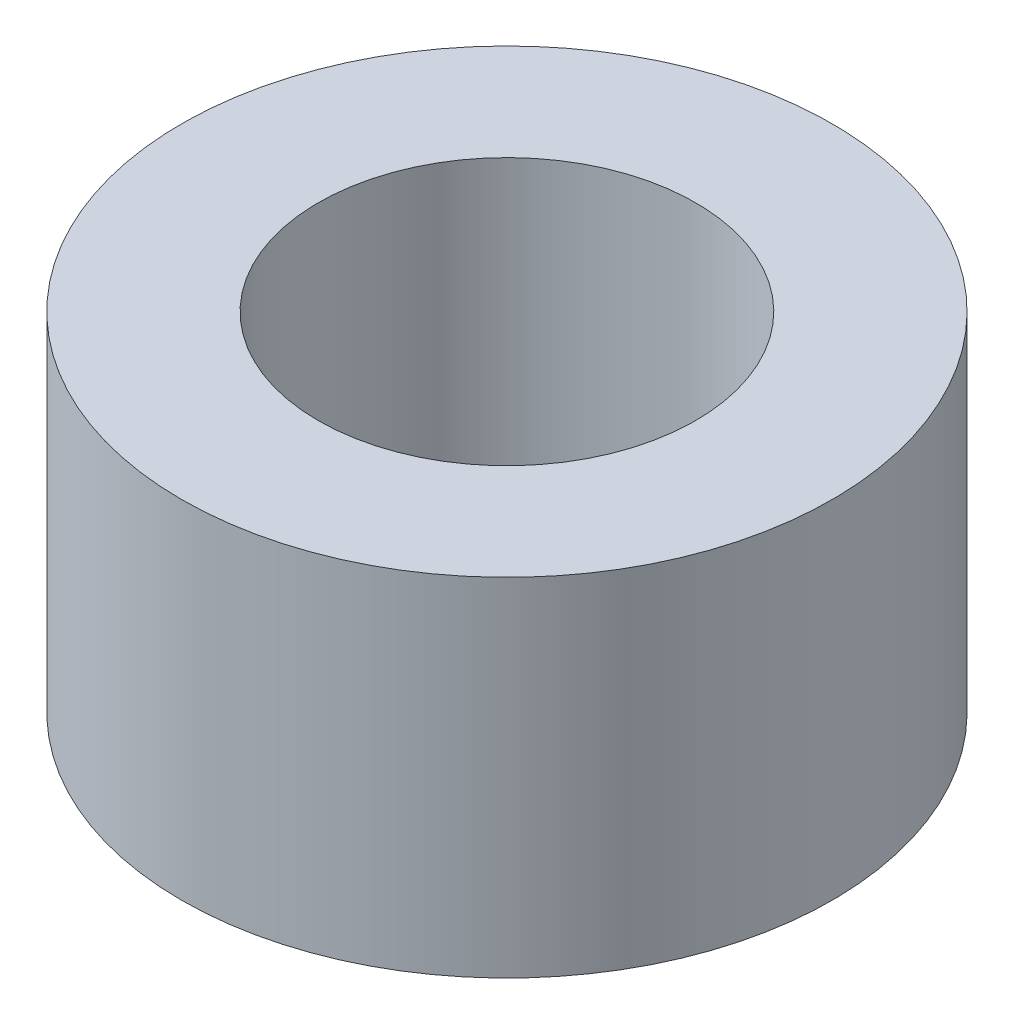
ISO-10303-21;
HEADER;
FILE_DESCRIPTION(('STEP AP214'),'2;1');
FILE_NAME('part.step','',(''),(''),'','','');
FILE_SCHEMA(('AUTOMOTIVE_DESIGN { 1 0 10303 214 1 1 1 1 }'));
ENDSEC;
DATA;
#1=APPLICATION_CONTEXT('core data for automotive mechanical design processes');
#2=APPLICATION_PROTOCOL_DEFINITION('international standard','automotive_design',2000,#1);
#3=PRODUCT_CONTEXT('',#1,'mechanical');
#4=PRODUCT('Part','Part','',(#3));
#5=PRODUCT_RELATED_PRODUCT_CATEGORY('part','',(#4));
#6=PRODUCT_DEFINITION_FORMATION('','',#4);
#7=PRODUCT_DEFINITION_CONTEXT('part definition',#1,'design');
#8=PRODUCT_DEFINITION('design','',#6,#7);
#9=PRODUCT_DEFINITION_SHAPE('','',#8);
#10=(LENGTH_UNIT() NAMED_UNIT(*) SI_UNIT(.MILLI.,.METRE.));
#11=(NAMED_UNIT(*) PLANE_ANGLE_UNIT() SI_UNIT($,.RADIAN.));
#12=(NAMED_UNIT(*) SI_UNIT($,.STERADIAN.) SOLID_ANGLE_UNIT());
#13=UNCERTAINTY_MEASURE_WITH_UNIT(LENGTH_MEASURE(1.E-05),#10,'distance_accuracy_value','');
#14=(GEOMETRIC_REPRESENTATION_CONTEXT(3) GLOBAL_UNCERTAINTY_ASSIGNED_CONTEXT((#13)) GLOBAL_UNIT_ASSIGNED_CONTEXT((#10,
#11,#12)) REPRESENTATION_CONTEXT('',''));
#15=CARTESIAN_POINT('',(0.,0.,0.));
#16=DIRECTION('',(0.,0.,1.));
#17=DIRECTION('',(1.,0.,0.));
#18=AXIS2_PLACEMENT_3D('',#15,#16,#17);
#19=CARTESIAN_POINT('',(0.,8.,0.));
#20=DIRECTION('',(0.,1.,0.));
#21=DIRECTION('',(0.,0.,1.));
#22=AXIS2_PLACEMENT_3D('',#19,#20,#21);
#23=PLANE('',#22);
#24=CARTESIAN_POINT('',(0.,8.,0.));
#25=DIRECTION('',(0.,1.,0.));
#26=DIRECTION('',(0.,0.,1.));
#27=AXIS2_PLACEMENT_3D('',#24,#25,#26);
#28=CIRCLE('',#27,7.5);
#29=CARTESIAN_POINT('',(0.,8.,7.5));
#30=VERTEX_POINT('',#29);
#31=EDGE_CURVE('E10',#30,#30,#28,.T.);
#32=ORIENTED_EDGE('',*,*,#31,.T.);
#33=EDGE_LOOP('',(#32));
#34=FACE_BOUND('',#33,.T.);
#35=CARTESIAN_POINT('',(0.,8.,0.));
#36=DIRECTION('',(0.,1.,0.));
#37=DIRECTION('',(0.,0.,1.));
#38=AXIS2_PLACEMENT_3D('',#35,#36,#37);
#39=CIRCLE('',#38,4.35);
#40=CARTESIAN_POINT('',(0.,8.,4.35));
#41=VERTEX_POINT('',#40);
#42=EDGE_CURVE('E48',#41,#41,#39,.T.);
#43=ORIENTED_EDGE('',*,*,#42,.F.);
#44=EDGE_LOOP('',(#43));
#45=FACE_BOUND('',#44,.T.);
#46=ADVANCED_FACE('F37',(#34,#45),#23,.T.);
#47=CARTESIAN_POINT('',(0.,0.,0.));
#48=DIRECTION('',(0.,1.,0.));
#49=DIRECTION('',(0.,0.,1.));
#50=AXIS2_PLACEMENT_3D('',#47,#48,#49);
#51=PLANE('',#50);
#52=CARTESIAN_POINT('',(0.,0.,0.));
#53=DIRECTION('',(0.,1.,0.));
#54=DIRECTION('',(0.,0.,1.));
#55=AXIS2_PLACEMENT_3D('',#52,#53,#54);
#56=CIRCLE('',#55,7.5);
#57=CARTESIAN_POINT('',(0.,0.,7.5));
#58=VERTEX_POINT('',#57);
#59=EDGE_CURVE('E41',#58,#58,#56,.T.);
#60=ORIENTED_EDGE('',*,*,#59,.F.);
#61=EDGE_LOOP('',(#60));
#62=FACE_BOUND('',#61,.T.);
#63=CARTESIAN_POINT('',(0.,0.,0.));
#64=DIRECTION('',(0.,1.,0.));
#65=DIRECTION('',(0.,0.,1.));
#66=AXIS2_PLACEMENT_3D('',#63,#64,#65);
#67=CIRCLE('',#66,4.35);
#68=CARTESIAN_POINT('',(0.,0.,4.35));
#69=VERTEX_POINT('',#68);
#70=EDGE_CURVE('E50',#69,#69,#67,.T.);
#71=ORIENTED_EDGE('',*,*,#70,.T.);
#72=EDGE_LOOP('',(#71));
#73=FACE_BOUND('',#72,.T.);
#74=ADVANCED_FACE('F60',(#62,#73),#51,.F.);
#75=CARTESIAN_POINT('',(0.,8.,0.));
#76=DIRECTION('',(0.,-1.,0.));
#77=DIRECTION('',(0.,0.,-1.));
#78=AXIS2_PLACEMENT_3D('',#75,#76,#77);
#79=CYLINDRICAL_SURFACE('',#78,7.5);
#80=ORIENTED_EDGE('',*,*,#31,.F.);
#81=EDGE_LOOP('',(#80));
#82=FACE_BOUND('',#81,.T.);
#83=ORIENTED_EDGE('',*,*,#59,.T.);
#84=EDGE_LOOP('',(#83));
#85=FACE_BOUND('',#84,.T.);
#86=ADVANCED_FACE('F39',(#82,#85),#79,.T.);
#87=CARTESIAN_POINT('',(0.,8.,0.));
#88=DIRECTION('',(0.,-1.,0.));
#89=DIRECTION('',(0.,0.,-1.));
#90=AXIS2_PLACEMENT_3D('',#87,#88,#89);
#91=CYLINDRICAL_SURFACE('',#90,4.35);
#92=ORIENTED_EDGE('',*,*,#42,.T.);
#93=EDGE_LOOP('',(#92));
#94=FACE_BOUND('',#93,.T.);
#95=ORIENTED_EDGE('',*,*,#70,.F.);
#96=EDGE_LOOP('',(#95));
#97=FACE_BOUND('',#96,.T.);
#98=ADVANCED_FACE('F56',(#94,#97),#91,.F.);
#99=CLOSED_SHELL('',(#46,#74,#86,#98));
#100=MANIFOLD_SOLID_BREP('B2',#99);
#101=ADVANCED_BREP_SHAPE_REPRESENTATION('',(#18,#100),#14);
#102=SHAPE_DEFINITION_REPRESENTATION(#9,#101);
ENDSEC;
END-ISO-10303-21;
